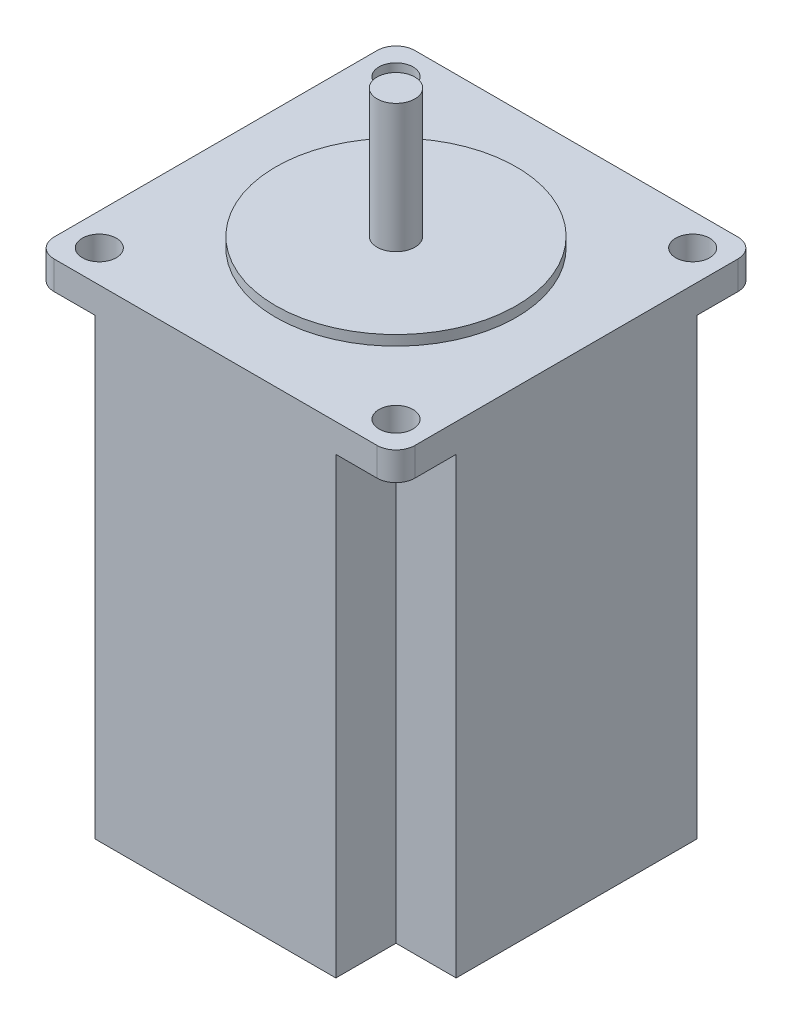
ISO-10303-21;
HEADER;
FILE_DESCRIPTION(('STEP AP214'),'2;1');
FILE_NAME('part.step','',(''),(''),'','','');
FILE_SCHEMA(('AUTOMOTIVE_DESIGN { 1 0 10303 214 1 1 1 1 }'));
ENDSEC;
DATA;
#1=APPLICATION_CONTEXT('core data for automotive mechanical design processes');
#2=APPLICATION_PROTOCOL_DEFINITION('international standard','automotive_design',2000,#1);
#3=PRODUCT_CONTEXT('',#1,'mechanical');
#4=PRODUCT('Part','Part','',(#3));
#5=PRODUCT_RELATED_PRODUCT_CATEGORY('part','',(#4));
#6=PRODUCT_DEFINITION_FORMATION('','',#4);
#7=PRODUCT_DEFINITION_CONTEXT('part definition',#1,'design');
#8=PRODUCT_DEFINITION('design','',#6,#7);
#9=PRODUCT_DEFINITION_SHAPE('','',#8);
#10=(LENGTH_UNIT() NAMED_UNIT(*) SI_UNIT(.MILLI.,.METRE.));
#11=(NAMED_UNIT(*) PLANE_ANGLE_UNIT() SI_UNIT($,.RADIAN.));
#12=(NAMED_UNIT(*) SI_UNIT($,.STERADIAN.) SOLID_ANGLE_UNIT());
#13=UNCERTAINTY_MEASURE_WITH_UNIT(LENGTH_MEASURE(1.E-05),#10,'distance_accuracy_value','');
#14=(GEOMETRIC_REPRESENTATION_CONTEXT(3) GLOBAL_UNCERTAINTY_ASSIGNED_CONTEXT((#13)) GLOBAL_UNIT_ASSIGNED_CONTEXT((#10,
#11,#12)) REPRESENTATION_CONTEXT('',''));
#15=CARTESIAN_POINT('',(0.,0.,0.));
#16=DIRECTION('',(0.,0.,1.));
#17=DIRECTION('',(1.,0.,0.));
#18=AXIS2_PLACEMENT_3D('',#15,#16,#17);
#19=CARTESIAN_POINT('',(-30.25,0.,0.));
#20=DIRECTION('',(1.,0.,0.));
#21=DIRECTION('',(0.,0.,-1.));
#22=AXIS2_PLACEMENT_3D('',#19,#20,#21);
#23=PLANE('',#22);
#24=DIRECTION('',(0.,1.,0.));
#25=VECTOR('',#24,1.);
#26=CARTESIAN_POINT('',(-30.25,0.,4.));
#27=LINE('',#26,#25);
#28=CARTESIAN_POINT('',(-30.25,0.,4.));
#29=VERTEX_POINT('',#28);
#30=CARTESIAN_POINT('',(-30.25,2.,4.));
#31=VERTEX_POINT('',#30);
#32=EDGE_CURVE('E59',#29,#31,#27,.T.);
#33=ORIENTED_EDGE('',*,*,#32,.F.);
#34=DIRECTION('',(0.,0.,1.));
#35=VECTOR('',#34,1.);
#36=CARTESIAN_POINT('',(-30.25,0.,0.));
#37=LINE('',#36,#35);
#38=CARTESIAN_POINT('',(-30.25,0.,5.45));
#39=VERTEX_POINT('',#38);
#40=EDGE_CURVE('E246',#29,#39,#37,.T.);
#41=ORIENTED_EDGE('',*,*,#40,.T.);
#42=DIRECTION('',(0.,1.,0.));
#43=VECTOR('',#42,1.);
#44=CARTESIAN_POINT('',(-30.25,9.6,5.45));
#45=LINE('',#44,#43);
#46=CARTESIAN_POINT('',(-30.25,9.6,5.45));
#47=VERTEX_POINT('',#46);
#48=EDGE_CURVE('E258',#39,#47,#45,.T.);
#49=ORIENTED_EDGE('',*,*,#48,.T.);
#50=DIRECTION('',(0.,0.,-1.));
#51=VECTOR('',#50,1.);
#52=CARTESIAN_POINT('',(-30.25,9.6,-5.45));
#53=LINE('',#52,#51);
#54=CARTESIAN_POINT('',(-30.25,9.6,-5.45));
#55=VERTEX_POINT('',#54);
#56=EDGE_CURVE('E260',#47,#55,#53,.T.);
#57=ORIENTED_EDGE('',*,*,#56,.T.);
#58=DIRECTION('',(0.,-1.,0.));
#59=VECTOR('',#58,1.);
#60=CARTESIAN_POINT('',(-30.25,0.,-5.45));
#61=LINE('',#60,#59);
#62=CARTESIAN_POINT('',(-30.25,0.,-5.45));
#63=VERTEX_POINT('',#62);
#64=EDGE_CURVE('E262',#55,#63,#61,.T.);
#65=ORIENTED_EDGE('',*,*,#64,.T.);
#66=CARTESIAN_POINT('',(-30.25,0.,-4.));
#67=VERTEX_POINT('',#66);
#68=EDGE_CURVE('E256',#63,#67,#37,.T.);
#69=ORIENTED_EDGE('',*,*,#68,.T.);
#70=DIRECTION('',(0.,-1.,0.));
#71=VECTOR('',#70,1.);
#72=CARTESIAN_POINT('',(-30.25,2.,-4.));
#73=LINE('',#72,#71);
#74=CARTESIAN_POINT('',(-30.25,2.,-4.));
#75=VERTEX_POINT('',#74);
#76=EDGE_CURVE('E241',#75,#67,#73,.T.);
#77=ORIENTED_EDGE('',*,*,#76,.F.);
#78=DIRECTION('',(0.,0.,-1.));
#79=VECTOR('',#78,1.);
#80=CARTESIAN_POINT('',(-30.25,2.,4.));
#81=LINE('',#80,#79);
#82=EDGE_CURVE('E55',#31,#75,#81,.T.);
#83=ORIENTED_EDGE('',*,*,#82,.F.);
#84=EDGE_LOOP('',(#33,#41,#49,#57,#65,#69,#77,#83));
#85=FACE_BOUND('',#84,.T.);
#86=ADVANCED_FACE('F40',(#85),#23,.F.);
#87=CARTESIAN_POINT('',(-28.65,76.5,-28.65));
#88=DIRECTION('',(1.,0.,0.));
#89=DIRECTION('',(0.,0.,-1.));
#90=AXIS2_PLACEMENT_3D('',#87,#88,#89);
#91=PLANE('',#90);
#92=DIRECTION('',(0.,1.,0.));
#93=VECTOR('',#92,1.);
#94=CARTESIAN_POINT('',(-28.65,9.6,5.45));
#95=LINE('',#94,#93);
#96=CARTESIAN_POINT('',(-28.65,0.,5.45000000000001));
#97=VERTEX_POINT('',#96);
#98=CARTESIAN_POINT('',(-28.65,9.6,5.45));
#99=VERTEX_POINT('',#98);
#100=EDGE_CURVE('E247',#97,#99,#95,.T.);
#101=ORIENTED_EDGE('',*,*,#100,.F.);
#102=DIRECTION('',(0.,0.,1.));
#103=VECTOR('',#102,1.);
#104=CARTESIAN_POINT('',(-28.65,0.,-28.65));
#105=LINE('',#104,#103);
#106=CARTESIAN_POINT('',(-28.65,0.,19.1));
#107=VERTEX_POINT('',#106);
#108=EDGE_CURVE('E405',#97,#107,#105,.T.);
#109=ORIENTED_EDGE('',*,*,#108,.T.);
#110=DIRECTION('',(0.,-1.,0.));
#111=VECTOR('',#110,1.);
#112=CARTESIAN_POINT('',(-28.65,72.,19.1));
#113=LINE('',#112,#111);
#114=CARTESIAN_POINT('',(-28.65,72.,19.1));
#115=VERTEX_POINT('',#114);
#116=EDGE_CURVE('E398',#115,#107,#113,.T.);
#117=ORIENTED_EDGE('',*,*,#116,.F.);
#118=DIRECTION('',(0.,0.,-1.));
#119=VECTOR('',#118,1.);
#120=CARTESIAN_POINT('',(-28.65,72.,19.1));
#121=LINE('',#120,#119);
#122=CARTESIAN_POINT('',(-28.65,72.,25.65));
#123=VERTEX_POINT('',#122);
#124=EDGE_CURVE('E386',#123,#115,#121,.T.);
#125=ORIENTED_EDGE('',*,*,#124,.F.);
#126=DIRECTION('',(0.,-1.,0.));
#127=VECTOR('',#126,1.);
#128=CARTESIAN_POINT('',(-28.65,76.5,25.65));
#129=LINE('',#128,#127);
#130=CARTESIAN_POINT('',(-28.65,76.5,25.65));
#131=VERTEX_POINT('',#130);
#132=EDGE_CURVE('E48',#123,#131,#129,.F.);
#133=ORIENTED_EDGE('',*,*,#132,.T.);
#134=DIRECTION('',(0.,0.,1.));
#135=VECTOR('',#134,1.);
#136=CARTESIAN_POINT('',(-28.65,76.5,-28.65));
#137=LINE('',#136,#135);
#138=CARTESIAN_POINT('',(-28.65,76.5,-25.65));
#139=VERTEX_POINT('',#138);
#140=EDGE_CURVE('E410',#139,#131,#137,.T.);
#141=ORIENTED_EDGE('',*,*,#140,.F.);
#142=DIRECTION('',(0.,-1.,0.));
#143=VECTOR('',#142,1.);
#144=CARTESIAN_POINT('',(-28.65,72.,-25.65));
#145=LINE('',#144,#143);
#146=CARTESIAN_POINT('',(-28.65,72.,-25.65));
#147=VERTEX_POINT('',#146);
#148=EDGE_CURVE('E458',#139,#147,#145,.T.);
#149=ORIENTED_EDGE('',*,*,#148,.T.);
#150=DIRECTION('',(0.,0.,1.));
#151=VECTOR('',#150,1.);
#152=CARTESIAN_POINT('',(-28.65,72.,-19.1));
#153=LINE('',#152,#151);
#154=CARTESIAN_POINT('',(-28.65,72.,-19.1));
#155=VERTEX_POINT('',#154);
#156=EDGE_CURVE('E320',#147,#155,#153,.T.);
#157=ORIENTED_EDGE('',*,*,#156,.T.);
#158=DIRECTION('',(0.,-1.,0.));
#159=VECTOR('',#158,1.);
#160=CARTESIAN_POINT('',(-28.65,72.,-19.1));
#161=LINE('',#160,#159);
#162=CARTESIAN_POINT('',(-28.65,0.,-19.1));
#163=VERTEX_POINT('',#162);
#164=EDGE_CURVE('E334',#155,#163,#161,.T.);
#165=ORIENTED_EDGE('',*,*,#164,.T.);
#166=CARTESIAN_POINT('',(-28.65,0.,-5.45));
#167=VERTEX_POINT('',#166);
#168=EDGE_CURVE('E422',#163,#167,#105,.T.);
#169=ORIENTED_EDGE('',*,*,#168,.T.);
#170=DIRECTION('',(0.,-1.,0.));
#171=VECTOR('',#170,1.);
#172=CARTESIAN_POINT('',(-28.65,0.,-5.45));
#173=LINE('',#172,#171);
#174=CARTESIAN_POINT('',(-28.65,9.6,-5.45));
#175=VERTEX_POINT('',#174);
#176=EDGE_CURVE('E267',#175,#167,#173,.T.);
#177=ORIENTED_EDGE('',*,*,#176,.F.);
#178=DIRECTION('',(0.,0.,-1.));
#179=VECTOR('',#178,1.);
#180=CARTESIAN_POINT('',(-28.65,9.6,-5.45));
#181=LINE('',#180,#179);
#182=EDGE_CURVE('E250',#99,#175,#181,.T.);
#183=ORIENTED_EDGE('',*,*,#182,.F.);
#184=EDGE_LOOP('',(#101,#109,#117,#125,#133,#141,#149,#157,#165,#169,#177,#183));
#185=FACE_BOUND('',#184,.T.);
#186=ADVANCED_FACE('F464',(#185),#91,.F.);
#187=CARTESIAN_POINT('',(0.,0.,0.));
#188=DIRECTION('',(0.,1.,0.));
#189=DIRECTION('',(0.,0.,1.));
#190=AXIS2_PLACEMENT_3D('',#187,#188,#189);
#191=PLANE('',#190);
#192=CARTESIAN_POINT('',(0.,0.,0.));
#193=DIRECTION('',(0.,-1.,0.));
#194=DIRECTION('',(0.,0.,-1.));
#195=AXIS2_PLACEMENT_3D('',#192,#193,#194);
#196=CIRCLE('',#195,3.);
#197=CARTESIAN_POINT('',(0.,0.,-3.));
#198=VERTEX_POINT('',#197);
#199=EDGE_CURVE('E962',#198,#198,#196,.T.);
#200=ORIENTED_EDGE('',*,*,#199,.F.);
#201=EDGE_LOOP('',(#200));
#202=FACE_BOUND('',#201,.T.);
#203=DIRECTION('',(1.,0.,0.));
#204=VECTOR('',#203,1.);
#205=CARTESIAN_POINT('',(-19.1,0.,-19.1));
#206=LINE('',#205,#204);
#207=CARTESIAN_POINT('',(-19.1,0.,-19.1));
#208=VERTEX_POINT('',#207);
#209=EDGE_CURVE('E323',#163,#208,#206,.T.);
#210=ORIENTED_EDGE('',*,*,#209,.T.);
#211=DIRECTION('',(0.,0.,-1.));
#212=VECTOR('',#211,1.);
#213=CARTESIAN_POINT('',(-19.1,0.,-28.65));
#214=LINE('',#213,#212);
#215=CARTESIAN_POINT('',(-19.1,0.,-28.65));
#216=VERTEX_POINT('',#215);
#217=EDGE_CURVE('E316',#208,#216,#214,.T.);
#218=ORIENTED_EDGE('',*,*,#217,.T.);
#219=DIRECTION('',(1.,0.,0.));
#220=VECTOR('',#219,1.);
#221=CARTESIAN_POINT('',(-28.65,0.,-28.65));
#222=LINE('',#221,#220);
#223=CARTESIAN_POINT('',(19.1,0.,-28.65));
#224=VERTEX_POINT('',#223);
#225=EDGE_CURVE('E414',#216,#224,#222,.T.);
#226=ORIENTED_EDGE('',*,*,#225,.T.);
#227=DIRECTION('',(0.,0.,-1.));
#228=VECTOR('',#227,1.);
#229=CARTESIAN_POINT('',(19.1,0.,-28.65));
#230=LINE('',#229,#228);
#231=CARTESIAN_POINT('',(19.1,0.,-19.1));
#232=VERTEX_POINT('',#231);
#233=EDGE_CURVE('E344',#232,#224,#230,.T.);
#234=ORIENTED_EDGE('',*,*,#233,.F.);
#235=DIRECTION('',(-1.,0.,0.));
#236=VECTOR('',#235,1.);
#237=CARTESIAN_POINT('',(19.1,0.,-19.1));
#238=LINE('',#237,#236);
#239=CARTESIAN_POINT('',(28.65,0.,-19.1));
#240=VERTEX_POINT('',#239);
#241=EDGE_CURVE('E337',#240,#232,#238,.T.);
#242=ORIENTED_EDGE('',*,*,#241,.F.);
#243=DIRECTION('',(0.,0.,1.));
#244=VECTOR('',#243,1.);
#245=CARTESIAN_POINT('',(28.65,0.,-28.65));
#246=LINE('',#245,#244);
#247=CARTESIAN_POINT('',(28.65,0.,19.1));
#248=VERTEX_POINT('',#247);
#249=EDGE_CURVE('E427',#240,#248,#246,.T.);
#250=ORIENTED_EDGE('',*,*,#249,.T.);
#251=DIRECTION('',(-1.,0.,0.));
#252=VECTOR('',#251,1.);
#253=CARTESIAN_POINT('',(19.1,0.,19.1));
#254=LINE('',#253,#252);
#255=CARTESIAN_POINT('',(19.1,0.,19.1));
#256=VERTEX_POINT('',#255);
#257=EDGE_CURVE('E367',#248,#256,#254,.T.);
#258=ORIENTED_EDGE('',*,*,#257,.T.);
#259=DIRECTION('',(0.,0.,1.));
#260=VECTOR('',#259,1.);
#261=CARTESIAN_POINT('',(19.1,0.,28.65));
#262=LINE('',#261,#260);
#263=CARTESIAN_POINT('',(19.1,0.,28.65));
#264=VERTEX_POINT('',#263);
#265=EDGE_CURVE('E360',#256,#264,#262,.T.);
#266=ORIENTED_EDGE('',*,*,#265,.T.);
#267=DIRECTION('',(1.,0.,0.));
#268=VECTOR('',#267,1.);
#269=CARTESIAN_POINT('',(-28.65,0.,28.65));
#270=LINE('',#269,#268);
#271=CARTESIAN_POINT('',(-19.1,0.,28.65));
#272=VERTEX_POINT('',#271);
#273=EDGE_CURVE('E424',#272,#264,#270,.T.);
#274=ORIENTED_EDGE('',*,*,#273,.F.);
#275=DIRECTION('',(0.,0.,1.));
#276=VECTOR('',#275,1.);
#277=CARTESIAN_POINT('',(-19.1,0.,28.65));
#278=LINE('',#277,#276);
#279=CARTESIAN_POINT('',(-19.1,0.,19.1));
#280=VERTEX_POINT('',#279);
#281=EDGE_CURVE('E389',#280,#272,#278,.T.);
#282=ORIENTED_EDGE('',*,*,#281,.F.);
#283=DIRECTION('',(1.,0.,0.));
#284=VECTOR('',#283,1.);
#285=CARTESIAN_POINT('',(-19.1,0.,19.1));
#286=LINE('',#285,#284);
#287=EDGE_CURVE('E382',#107,#280,#286,.T.);
#288=ORIENTED_EDGE('',*,*,#287,.F.);
#289=ORIENTED_EDGE('',*,*,#108,.F.);
#290=DIRECTION('',(1.,0.,0.));
#291=VECTOR('',#290,1.);
#292=CARTESIAN_POINT('',(-30.25,0.,5.45));
#293=LINE('',#292,#291);
#294=EDGE_CURVE('E278',#39,#97,#293,.T.);
#295=ORIENTED_EDGE('',*,*,#294,.F.);
#296=ORIENTED_EDGE('',*,*,#40,.F.);
#297=DIRECTION('',(1.,0.,0.));
#298=VECTOR('',#297,1.);
#299=CARTESIAN_POINT('',(-35.35,0.,4.));
#300=LINE('',#299,#298);
#301=CARTESIAN_POINT('',(-35.35,0.,4.));
#302=VERTEX_POINT('',#301);
#303=EDGE_CURVE('E226',#302,#29,#300,.T.);
#304=ORIENTED_EDGE('',*,*,#303,.F.);
#305=DIRECTION('',(0.,0.,1.));
#306=VECTOR('',#305,1.);
#307=CARTESIAN_POINT('',(-35.35,0.,0.));
#308=LINE('',#307,#306);
#309=CARTESIAN_POINT('',(-35.35,0.,-4.));
#310=VERTEX_POINT('',#309);
#311=EDGE_CURVE('E232',#310,#302,#308,.T.);
#312=ORIENTED_EDGE('',*,*,#311,.F.);
#313=DIRECTION('',(1.,0.,0.));
#314=VECTOR('',#313,1.);
#315=CARTESIAN_POINT('',(-35.35,0.,-4.));
#316=LINE('',#315,#314);
#317=EDGE_CURVE('E971',#310,#67,#316,.T.);
#318=ORIENTED_EDGE('',*,*,#317,.T.);
#319=ORIENTED_EDGE('',*,*,#68,.F.);
#320=DIRECTION('',(1.,0.,0.));
#321=VECTOR('',#320,1.);
#322=CARTESIAN_POINT('',(-30.25,0.,-5.45));
#323=LINE('',#322,#321);
#324=EDGE_CURVE('E263',#63,#167,#323,.T.);
#325=ORIENTED_EDGE('',*,*,#324,.T.);
#326=ORIENTED_EDGE('',*,*,#168,.F.);
#327=EDGE_LOOP('',(#210,#218,#226,#234,#242,#250,#258,#266,#274,#282,#288,#289,#295,#296,#304,
#312,#318,#319,#325,#326));
#328=FACE_BOUND('',#327,.T.);
#329=ADVANCED_FACE('F244',(#202,#328),#191,.F.);
#330=CARTESIAN_POINT('',(-28.65,76.5,-28.65));
#331=DIRECTION('',(0.,0.,-1.));
#332=DIRECTION('',(-1.,0.,0.));
#333=AXIS2_PLACEMENT_3D('',#330,#331,#332);
#334=PLANE('',#333);
#335=DIRECTION('',(1.,0.,0.));
#336=VECTOR('',#335,1.);
#337=CARTESIAN_POINT('',(-28.65,76.5,-28.65));
#338=LINE('',#337,#336);
#339=CARTESIAN_POINT('',(-25.65,76.5,-28.65));
#340=VERTEX_POINT('',#339);
#341=CARTESIAN_POINT('',(25.65,76.5,-28.65));
#342=VERTEX_POINT('',#341);
#343=EDGE_CURVE('E319',#340,#342,#338,.T.);
#344=ORIENTED_EDGE('',*,*,#343,.T.);
#345=DIRECTION('',(0.,-1.,0.));
#346=VECTOR('',#345,1.);
#347=CARTESIAN_POINT('',(25.65,76.5,-28.65));
#348=LINE('',#347,#346);
#349=CARTESIAN_POINT('',(25.65,72.,-28.65));
#350=VERTEX_POINT('',#349);
#351=EDGE_CURVE('E451',#342,#350,#348,.T.);
#352=ORIENTED_EDGE('',*,*,#351,.T.);
#353=DIRECTION('',(1.,0.,0.));
#354=VECTOR('',#353,1.);
#355=CARTESIAN_POINT('',(28.65,72.,-28.65));
#356=LINE('',#355,#354);
#357=CARTESIAN_POINT('',(19.1,72.,-28.65));
#358=VERTEX_POINT('',#357);
#359=EDGE_CURVE('E349',#358,#350,#356,.T.);
#360=ORIENTED_EDGE('',*,*,#359,.F.);
#361=DIRECTION('',(0.,-1.,0.));
#362=VECTOR('',#361,1.);
#363=CARTESIAN_POINT('',(19.1,72.,-28.65));
#364=LINE('',#363,#362);
#365=EDGE_CURVE('E357',#358,#224,#364,.T.);
#366=ORIENTED_EDGE('',*,*,#365,.T.);
#367=ORIENTED_EDGE('',*,*,#225,.F.);
#368=DIRECTION('',(0.,-1.,0.));
#369=VECTOR('',#368,1.);
#370=CARTESIAN_POINT('',(-19.1,72.,-28.65));
#371=LINE('',#370,#369);
#372=CARTESIAN_POINT('',(-19.1,72.,-28.65));
#373=VERTEX_POINT('',#372);
#374=EDGE_CURVE('E330',#373,#216,#371,.T.);
#375=ORIENTED_EDGE('',*,*,#374,.F.);
#376=DIRECTION('',(-1.,0.,0.));
#377=VECTOR('',#376,1.);
#378=CARTESIAN_POINT('',(-28.65,72.,-28.65));
#379=LINE('',#378,#377);
#380=CARTESIAN_POINT('',(-25.65,72.,-28.65));
#381=VERTEX_POINT('',#380);
#382=EDGE_CURVE('E322',#373,#381,#379,.T.);
#383=ORIENTED_EDGE('',*,*,#382,.T.);
#384=DIRECTION('',(0.,-1.,0.));
#385=VECTOR('',#384,1.);
#386=CARTESIAN_POINT('',(-25.65,76.5,-28.65));
#387=LINE('',#386,#385);
#388=EDGE_CURVE('E449',#381,#340,#387,.F.);
#389=ORIENTED_EDGE('',*,*,#388,.T.);
#390=EDGE_LOOP('',(#344,#352,#360,#366,#367,#375,#383,#389));
#391=FACE_BOUND('',#390,.T.);
#392=ADVANCED_FACE('F514',(#391),#334,.T.);
#393=CARTESIAN_POINT('',(-28.65,76.5,28.65));
#394=DIRECTION('',(0.,0.,-1.));
#395=DIRECTION('',(-1.,0.,0.));
#396=AXIS2_PLACEMENT_3D('',#393,#394,#395);
#397=PLANE('',#396);
#398=DIRECTION('',(1.,0.,0.));
#399=VECTOR('',#398,1.);
#400=CARTESIAN_POINT('',(28.65,72.,28.65));
#401=LINE('',#400,#399);
#402=CARTESIAN_POINT('',(19.1,72.,28.65));
#403=VERTEX_POINT('',#402);
#404=CARTESIAN_POINT('',(25.65,72.,28.65));
#405=VERTEX_POINT('',#404);
#406=EDGE_CURVE('E366',#403,#405,#401,.T.);
#407=ORIENTED_EDGE('',*,*,#406,.T.);
#408=DIRECTION('',(0.,-1.,0.));
#409=VECTOR('',#408,1.);
#410=CARTESIAN_POINT('',(25.65,76.5,28.65));
#411=LINE('',#410,#409);
#412=CARTESIAN_POINT('',(25.65,76.5,28.65));
#413=VERTEX_POINT('',#412);
#414=EDGE_CURVE('E439',#405,#413,#411,.F.);
#415=ORIENTED_EDGE('',*,*,#414,.T.);
#416=DIRECTION('',(1.,0.,0.));
#417=VECTOR('',#416,1.);
#418=CARTESIAN_POINT('',(-28.65,76.5,28.65));
#419=LINE('',#418,#417);
#420=CARTESIAN_POINT('',(-25.65,76.5,28.65));
#421=VERTEX_POINT('',#420);
#422=EDGE_CURVE('E413',#421,#413,#419,.T.);
#423=ORIENTED_EDGE('',*,*,#422,.F.);
#424=DIRECTION('',(0.,-1.,0.));
#425=VECTOR('',#424,1.);
#426=CARTESIAN_POINT('',(-25.65,76.5,28.65));
#427=LINE('',#426,#425);
#428=CARTESIAN_POINT('',(-25.65,72.,28.65));
#429=VERTEX_POINT('',#428);
#430=EDGE_CURVE('E436',#421,#429,#427,.T.);
#431=ORIENTED_EDGE('',*,*,#430,.T.);
#432=DIRECTION('',(-1.,0.,0.));
#433=VECTOR('',#432,1.);
#434=CARTESIAN_POINT('',(-28.65,72.,28.65));
#435=LINE('',#434,#433);
#436=CARTESIAN_POINT('',(-19.1,72.,28.65));
#437=VERTEX_POINT('',#436);
#438=EDGE_CURVE('E395',#437,#429,#435,.T.);
#439=ORIENTED_EDGE('',*,*,#438,.F.);
#440=DIRECTION('',(0.,-1.,0.));
#441=VECTOR('',#440,1.);
#442=CARTESIAN_POINT('',(-19.1,72.,28.65));
#443=LINE('',#442,#441);
#444=EDGE_CURVE('E402',#437,#272,#443,.T.);
#445=ORIENTED_EDGE('',*,*,#444,.T.);
#446=ORIENTED_EDGE('',*,*,#273,.T.);
#447=DIRECTION('',(0.,-1.,0.));
#448=VECTOR('',#447,1.);
#449=CARTESIAN_POINT('',(19.1,72.,28.65));
#450=LINE('',#449,#448);
#451=EDGE_CURVE('E374',#403,#264,#450,.T.);
#452=ORIENTED_EDGE('',*,*,#451,.F.);
#453=EDGE_LOOP('',(#407,#415,#423,#431,#439,#445,#446,#452));
#454=FACE_BOUND('',#453,.T.);
#455=ADVANCED_FACE('F478',(#454),#397,.F.);
#456=CARTESIAN_POINT('',(28.65,76.5,-28.65));
#457=DIRECTION('',(1.,0.,0.));
#458=DIRECTION('',(0.,0.,-1.));
#459=AXIS2_PLACEMENT_3D('',#456,#457,#458);
#460=PLANE('',#459);
#461=DIRECTION('',(0.,0.,1.));
#462=VECTOR('',#461,1.);
#463=CARTESIAN_POINT('',(28.65,76.5,-28.65));
#464=LINE('',#463,#462);
#465=CARTESIAN_POINT('',(28.65,76.5,-25.65));
#466=VERTEX_POINT('',#465);
#467=CARTESIAN_POINT('',(28.65,76.5,25.65));
#468=VERTEX_POINT('',#467);
#469=EDGE_CURVE('E417',#466,#468,#464,.T.);
#470=ORIENTED_EDGE('',*,*,#469,.T.);
#471=DIRECTION('',(0.,-1.,0.));
#472=VECTOR('',#471,1.);
#473=CARTESIAN_POINT('',(28.65,72.,25.65));
#474=LINE('',#473,#472);
#475=CARTESIAN_POINT('',(28.65,72.,25.65));
#476=VERTEX_POINT('',#475);
#477=EDGE_CURVE('E431',#468,#476,#474,.T.);
#478=ORIENTED_EDGE('',*,*,#477,.T.);
#479=DIRECTION('',(0.,0.,-1.));
#480=VECTOR('',#479,1.);
#481=CARTESIAN_POINT('',(28.65,72.,19.1));
#482=LINE('',#481,#480);
#483=CARTESIAN_POINT('',(28.65,72.,19.1));
#484=VERTEX_POINT('',#483);
#485=EDGE_CURVE('E364',#476,#484,#482,.T.);
#486=ORIENTED_EDGE('',*,*,#485,.T.);
#487=DIRECTION('',(0.,-1.,0.));
#488=VECTOR('',#487,1.);
#489=CARTESIAN_POINT('',(28.65,72.,19.1));
#490=LINE('',#489,#488);
#491=EDGE_CURVE('E379',#484,#248,#490,.T.);
#492=ORIENTED_EDGE('',*,*,#491,.T.);
#493=ORIENTED_EDGE('',*,*,#249,.F.);
#494=DIRECTION('',(0.,-1.,0.));
#495=VECTOR('',#494,1.);
#496=CARTESIAN_POINT('',(28.65,72.,-19.1));
#497=LINE('',#496,#495);
#498=CARTESIAN_POINT('',(28.65,72.,-19.1));
#499=VERTEX_POINT('',#498);
#500=EDGE_CURVE('E352',#499,#240,#497,.T.);
#501=ORIENTED_EDGE('',*,*,#500,.F.);
#502=DIRECTION('',(0.,0.,1.));
#503=VECTOR('',#502,1.);
#504=CARTESIAN_POINT('',(28.65,72.,-19.1));
#505=LINE('',#504,#503);
#506=CARTESIAN_POINT('',(28.65,72.,-25.65));
#507=VERTEX_POINT('',#506);
#508=EDGE_CURVE('E341',#507,#499,#505,.T.);
#509=ORIENTED_EDGE('',*,*,#508,.F.);
#510=DIRECTION('',(0.,-1.,0.));
#511=VECTOR('',#510,1.);
#512=CARTESIAN_POINT('',(28.65,76.5,-25.65));
#513=LINE('',#512,#511);
#514=EDGE_CURVE('E312',#507,#466,#513,.F.);
#515=ORIENTED_EDGE('',*,*,#514,.T.);
#516=EDGE_LOOP('',(#470,#478,#486,#492,#493,#501,#509,#515));
#517=FACE_BOUND('',#516,.T.);
#518=ADVANCED_FACE('F505',(#517),#460,.T.);
#519=CARTESIAN_POINT('',(0.,76.5,0.));
#520=DIRECTION('',(0.,1.,0.));
#521=DIRECTION('',(0.,0.,1.));
#522=AXIS2_PLACEMENT_3D('',#519,#520,#521);
#523=PLANE('',#522);
#524=CARTESIAN_POINT('',(-23.55,76.5,23.55));
#525=DIRECTION('',(0.,1.,0.));
#526=DIRECTION('',(0.,0.,1.));
#527=AXIS2_PLACEMENT_3D('',#524,#525,#526);
#528=CIRCLE('',#527,2.7);
#529=CARTESIAN_POINT('',(-23.55,76.5,26.25));
#530=VERTEX_POINT('',#529);
#531=EDGE_CURVE('E281',#530,#530,#528,.T.);
#532=ORIENTED_EDGE('',*,*,#531,.F.);
#533=EDGE_LOOP('',(#532));
#534=FACE_BOUND('',#533,.T.);
#535=CARTESIAN_POINT('',(23.55,76.5,23.55));
#536=DIRECTION('',(0.,1.,0.));
#537=DIRECTION('',(0.,0.,1.));
#538=AXIS2_PLACEMENT_3D('',#535,#536,#537);
#539=CIRCLE('',#538,2.7);
#540=CARTESIAN_POINT('',(23.55,76.5,26.25));
#541=VERTEX_POINT('',#540);
#542=EDGE_CURVE('E290',#541,#541,#539,.T.);
#543=ORIENTED_EDGE('',*,*,#542,.F.);
#544=EDGE_LOOP('',(#543));
#545=FACE_BOUND('',#544,.T.);
#546=CARTESIAN_POINT('',(23.55,76.5,-23.55));
#547=DIRECTION('',(0.,1.,0.));
#548=DIRECTION('',(0.,0.,1.));
#549=AXIS2_PLACEMENT_3D('',#546,#547,#548);
#550=CIRCLE('',#549,2.7);
#551=CARTESIAN_POINT('',(23.55,76.5,-20.85));
#552=VERTEX_POINT('',#551);
#553=EDGE_CURVE('E282',#552,#552,#550,.T.);
#554=ORIENTED_EDGE('',*,*,#553,.F.);
#555=EDGE_LOOP('',(#554));
#556=FACE_BOUND('',#555,.T.);
#557=CARTESIAN_POINT('',(-23.55,76.5,-23.55));
#558=DIRECTION('',(0.,1.,0.));
#559=DIRECTION('',(0.,0.,1.));
#560=AXIS2_PLACEMENT_3D('',#557,#558,#559);
#561=CIRCLE('',#560,2.7);
#562=CARTESIAN_POINT('',(-23.55,76.5,-20.85));
#563=VERTEX_POINT('',#562);
#564=EDGE_CURVE('E289',#563,#563,#561,.T.);
#565=ORIENTED_EDGE('',*,*,#564,.F.);
#566=EDGE_LOOP('',(#565));
#567=FACE_BOUND('',#566,.T.);
#568=CARTESIAN_POINT('',(0.,76.5,0.));
#569=DIRECTION('',(0.,1.,0.));
#570=DIRECTION('',(0.,0.,1.));
#571=AXIS2_PLACEMENT_3D('',#568,#569,#570);
#572=CIRCLE('',#571,19.1);
#573=CARTESIAN_POINT('',(0.,76.5,19.1));
#574=VERTEX_POINT('',#573);
#575=EDGE_CURVE('E313',#574,#574,#572,.T.);
#576=ORIENTED_EDGE('',*,*,#575,.F.);
#577=EDGE_LOOP('',(#576));
#578=FACE_BOUND('',#577,.T.);
#579=ORIENTED_EDGE('',*,*,#422,.T.);
#580=CARTESIAN_POINT('',(25.65,76.5,25.65));
#581=DIRECTION('',(0.,1.,0.));
#582=DIRECTION('',(0.,0.,1.));
#583=AXIS2_PLACEMENT_3D('',#580,#581,#582);
#584=CIRCLE('',#583,3.);
#585=EDGE_CURVE('E447',#413,#468,#584,.T.);
#586=ORIENTED_EDGE('',*,*,#585,.T.);
#587=ORIENTED_EDGE('',*,*,#469,.F.);
#588=CARTESIAN_POINT('',(25.65,76.5,-25.65));
#589=DIRECTION('',(0.,1.,0.));
#590=DIRECTION('',(0.,0.,1.));
#591=AXIS2_PLACEMENT_3D('',#588,#589,#590);
#592=CIRCLE('',#591,3.);
#593=EDGE_CURVE('E445',#466,#342,#592,.T.);
#594=ORIENTED_EDGE('',*,*,#593,.T.);
#595=ORIENTED_EDGE('',*,*,#343,.F.);
#596=CARTESIAN_POINT('',(-25.65,76.5,-25.65));
#597=DIRECTION('',(0.,1.,0.));
#598=DIRECTION('',(0.,0.,1.));
#599=AXIS2_PLACEMENT_3D('',#596,#597,#598);
#600=CIRCLE('',#599,3.);
#601=EDGE_CURVE('E441',#340,#139,#600,.T.);
#602=ORIENTED_EDGE('',*,*,#601,.T.);
#603=ORIENTED_EDGE('',*,*,#140,.T.);
#604=CARTESIAN_POINT('',(-25.65,76.5,25.65));
#605=DIRECTION('',(0.,1.,0.));
#606=DIRECTION('',(0.,0.,1.));
#607=AXIS2_PLACEMENT_3D('',#604,#605,#606);
#608=CIRCLE('',#607,3.);
#609=EDGE_CURVE('E443',#131,#421,#608,.T.);
#610=ORIENTED_EDGE('',*,*,#609,.T.);
#611=EDGE_LOOP('',(#579,#586,#587,#594,#595,#602,#603,#610));
#612=FACE_BOUND('',#611,.T.);
#613=ADVANCED_FACE('F470',(#534,#545,#556,#567,#578,#612),#523,.T.);
#614=CARTESIAN_POINT('',(-19.1,72.,28.65));
#615=DIRECTION('',(1.,0.,0.));
#616=DIRECTION('',(0.,0.,-1.));
#617=AXIS2_PLACEMENT_3D('',#614,#615,#616);
#618=PLANE('',#617);
#619=ORIENTED_EDGE('',*,*,#281,.T.);
#620=ORIENTED_EDGE('',*,*,#444,.F.);
#621=DIRECTION('',(0.,0.,1.));
#622=VECTOR('',#621,1.);
#623=CARTESIAN_POINT('',(-19.1,72.,28.65));
#624=LINE('',#623,#622);
#625=CARTESIAN_POINT('',(-19.1,72.,19.1));
#626=VERTEX_POINT('',#625);
#627=EDGE_CURVE('E392',#626,#437,#624,.T.);
#628=ORIENTED_EDGE('',*,*,#627,.F.);
#629=DIRECTION('',(0.,-1.,0.));
#630=VECTOR('',#629,1.);
#631=CARTESIAN_POINT('',(-19.1,72.,19.1));
#632=LINE('',#631,#630);
#633=EDGE_CURVE('E406',#626,#280,#632,.T.);
#634=ORIENTED_EDGE('',*,*,#633,.T.);
#635=EDGE_LOOP('',(#619,#620,#628,#634));
#636=FACE_BOUND('',#635,.T.);
#637=ADVANCED_FACE('F484',(#636),#618,.F.);
#638=CARTESIAN_POINT('',(-19.1,72.,19.1));
#639=DIRECTION('',(0.,0.,-1.));
#640=DIRECTION('',(-1.,0.,0.));
#641=AXIS2_PLACEMENT_3D('',#638,#639,#640);
#642=PLANE('',#641);
#643=ORIENTED_EDGE('',*,*,#287,.T.);
#644=ORIENTED_EDGE('',*,*,#633,.F.);
#645=DIRECTION('',(1.,0.,0.));
#646=VECTOR('',#645,1.);
#647=CARTESIAN_POINT('',(-19.1,72.,19.1));
#648=LINE('',#647,#646);
#649=EDGE_CURVE('E388',#115,#626,#648,.T.);
#650=ORIENTED_EDGE('',*,*,#649,.F.);
#651=ORIENTED_EDGE('',*,*,#116,.T.);
#652=EDGE_LOOP('',(#643,#644,#650,#651));
#653=FACE_BOUND('',#652,.T.);
#654=ADVANCED_FACE('F545',(#653),#642,.F.);
#655=CARTESIAN_POINT('',(0.,72.,0.));
#656=DIRECTION('',(0.,1.,0.));
#657=DIRECTION('',(0.,0.,1.));
#658=AXIS2_PLACEMENT_3D('',#655,#656,#657);
#659=PLANE('',#658);
#660=CARTESIAN_POINT('',(-23.55,72.,23.55));
#661=DIRECTION('',(0.,1.,0.));
#662=DIRECTION('',(0.,0.,1.));
#663=AXIS2_PLACEMENT_3D('',#660,#661,#662);
#664=CIRCLE('',#663,2.7);
#665=CARTESIAN_POINT('',(-23.55,72.,26.25));
#666=VERTEX_POINT('',#665);
#667=EDGE_CURVE('E293',#666,#666,#664,.F.);
#668=ORIENTED_EDGE('',*,*,#667,.F.);
#669=EDGE_LOOP('',(#668));
#670=FACE_BOUND('',#669,.T.);
#671=ORIENTED_EDGE('',*,*,#438,.T.);
#672=CARTESIAN_POINT('',(-25.65,72.,25.65));
#673=DIRECTION('',(0.,1.,0.));
#674=DIRECTION('',(0.,0.,1.));
#675=AXIS2_PLACEMENT_3D('',#672,#673,#674);
#676=CIRCLE('',#675,3.);
#677=EDGE_CURVE('E456',#429,#123,#676,.F.);
#678=ORIENTED_EDGE('',*,*,#677,.T.);
#679=ORIENTED_EDGE('',*,*,#124,.T.);
#680=ORIENTED_EDGE('',*,*,#649,.T.);
#681=ORIENTED_EDGE('',*,*,#627,.T.);
#682=EDGE_LOOP('',(#671,#678,#679,#680,#681));
#683=FACE_BOUND('',#682,.T.);
#684=ADVANCED_FACE('F480',(#670,#683),#659,.F.);
#685=CARTESIAN_POINT('',(19.1,72.,19.1));
#686=DIRECTION('',(0.,0.,1.));
#687=DIRECTION('',(1.,0.,0.));
#688=AXIS2_PLACEMENT_3D('',#685,#686,#687);
#689=PLANE('',#688);
#690=ORIENTED_EDGE('',*,*,#257,.F.);
#691=ORIENTED_EDGE('',*,*,#491,.F.);
#692=DIRECTION('',(-1.,0.,0.));
#693=VECTOR('',#692,1.);
#694=CARTESIAN_POINT('',(19.1,72.,19.1));
#695=LINE('',#694,#693);
#696=CARTESIAN_POINT('',(19.1,72.,19.1));
#697=VERTEX_POINT('',#696);
#698=EDGE_CURVE('E372',#484,#697,#695,.T.);
#699=ORIENTED_EDGE('',*,*,#698,.T.);
#700=DIRECTION('',(0.,-1.,0.));
#701=VECTOR('',#700,1.);
#702=CARTESIAN_POINT('',(19.1,72.,19.1));
#703=LINE('',#702,#701);
#704=EDGE_CURVE('E383',#697,#256,#703,.T.);
#705=ORIENTED_EDGE('',*,*,#704,.T.);
#706=EDGE_LOOP('',(#690,#691,#699,#705));
#707=FACE_BOUND('',#706,.T.);
#708=ADVANCED_FACE('F552',(#707),#689,.T.);
#709=CARTESIAN_POINT('',(19.1,72.,28.65));
#710=DIRECTION('',(1.,0.,0.));
#711=DIRECTION('',(0.,0.,-1.));
#712=AXIS2_PLACEMENT_3D('',#709,#710,#711);
#713=PLANE('',#712);
#714=ORIENTED_EDGE('',*,*,#265,.F.);
#715=ORIENTED_EDGE('',*,*,#704,.F.);
#716=DIRECTION('',(0.,0.,1.));
#717=VECTOR('',#716,1.);
#718=CARTESIAN_POINT('',(19.1,72.,28.65));
#719=LINE('',#718,#717);
#720=EDGE_CURVE('E370',#697,#403,#719,.T.);
#721=ORIENTED_EDGE('',*,*,#720,.T.);
#722=ORIENTED_EDGE('',*,*,#451,.T.);
#723=EDGE_LOOP('',(#714,#715,#721,#722));
#724=FACE_BOUND('',#723,.T.);
#725=ADVANCED_FACE('F493',(#724),#713,.T.);
#726=CARTESIAN_POINT('',(0.,72.,0.));
#727=DIRECTION('',(0.,1.,0.));
#728=DIRECTION('',(0.,0.,1.));
#729=AXIS2_PLACEMENT_3D('',#726,#727,#728);
#730=PLANE('',#729);
#731=CARTESIAN_POINT('',(23.55,72.,23.55));
#732=DIRECTION('',(0.,1.,0.));
#733=DIRECTION('',(0.,0.,1.));
#734=AXIS2_PLACEMENT_3D('',#731,#732,#733);
#735=CIRCLE('',#734,2.7);
#736=CARTESIAN_POINT('',(23.55,72.,26.25));
#737=VERTEX_POINT('',#736);
#738=EDGE_CURVE('E286',#737,#737,#735,.F.);
#739=ORIENTED_EDGE('',*,*,#738,.F.);
#740=EDGE_LOOP('',(#739));
#741=FACE_BOUND('',#740,.T.);
#742=ORIENTED_EDGE('',*,*,#485,.F.);
#743=CARTESIAN_POINT('',(25.65,72.,25.65));
#744=DIRECTION('',(0.,1.,0.));
#745=DIRECTION('',(0.,0.,1.));
#746=AXIS2_PLACEMENT_3D('',#743,#744,#745);
#747=CIRCLE('',#746,3.);
#748=EDGE_CURVE('E434',#476,#405,#747,.F.);
#749=ORIENTED_EDGE('',*,*,#748,.T.);
#750=ORIENTED_EDGE('',*,*,#406,.F.);
#751=ORIENTED_EDGE('',*,*,#720,.F.);
#752=ORIENTED_EDGE('',*,*,#698,.F.);
#753=EDGE_LOOP('',(#742,#749,#750,#751,#752));
#754=FACE_BOUND('',#753,.T.);
#755=ADVANCED_FACE('F621',(#741,#754),#730,.F.);
#756=CARTESIAN_POINT('',(19.1,72.,-28.65));
#757=DIRECTION('',(-1.,0.,0.));
#758=DIRECTION('',(0.,0.,1.));
#759=AXIS2_PLACEMENT_3D('',#756,#757,#758);
#760=PLANE('',#759);
#761=ORIENTED_EDGE('',*,*,#233,.T.);
#762=ORIENTED_EDGE('',*,*,#365,.F.);
#763=DIRECTION('',(0.,0.,-1.));
#764=VECTOR('',#763,1.);
#765=CARTESIAN_POINT('',(19.1,72.,-28.65));
#766=LINE('',#765,#764);
#767=CARTESIAN_POINT('',(19.1,72.,-19.1));
#768=VERTEX_POINT('',#767);
#769=EDGE_CURVE('E347',#768,#358,#766,.T.);
#770=ORIENTED_EDGE('',*,*,#769,.F.);
#771=DIRECTION('',(0.,-1.,0.));
#772=VECTOR('',#771,1.);
#773=CARTESIAN_POINT('',(19.1,72.,-19.1));
#774=LINE('',#773,#772);
#775=EDGE_CURVE('E361',#768,#232,#774,.T.);
#776=ORIENTED_EDGE('',*,*,#775,.T.);
#777=EDGE_LOOP('',(#761,#762,#770,#776));
#778=FACE_BOUND('',#777,.T.);
#779=ADVANCED_FACE('F618',(#778),#760,.F.);
#780=CARTESIAN_POINT('',(19.1,72.,-19.1));
#781=DIRECTION('',(0.,0.,1.));
#782=DIRECTION('',(1.,0.,0.));
#783=AXIS2_PLACEMENT_3D('',#780,#781,#782);
#784=PLANE('',#783);
#785=ORIENTED_EDGE('',*,*,#241,.T.);
#786=ORIENTED_EDGE('',*,*,#775,.F.);
#787=DIRECTION('',(-1.,0.,0.));
#788=VECTOR('',#787,1.);
#789=CARTESIAN_POINT('',(19.1,72.,-19.1));
#790=LINE('',#789,#788);
#791=EDGE_CURVE('E343',#499,#768,#790,.T.);
#792=ORIENTED_EDGE('',*,*,#791,.F.);
#793=ORIENTED_EDGE('',*,*,#500,.T.);
#794=EDGE_LOOP('',(#785,#786,#792,#793));
#795=FACE_BOUND('',#794,.T.);
#796=ADVANCED_FACE('F616',(#795),#784,.F.);
#797=CARTESIAN_POINT('',(0.,72.,0.));
#798=DIRECTION('',(0.,1.,0.));
#799=DIRECTION('',(0.,0.,-1.));
#800=AXIS2_PLACEMENT_3D('',#797,#798,#799);
#801=PLANE('',#800);
#802=CARTESIAN_POINT('',(23.55,72.,-23.55));
#803=DIRECTION('',(0.,1.,0.));
#804=DIRECTION('',(0.,0.,1.));
#805=AXIS2_PLACEMENT_3D('',#802,#803,#804);
#806=CIRCLE('',#805,2.7);
#807=CARTESIAN_POINT('',(23.55,72.,-20.85));
#808=VERTEX_POINT('',#807);
#809=EDGE_CURVE('E285',#808,#808,#806,.F.);
#810=ORIENTED_EDGE('',*,*,#809,.F.);
#811=EDGE_LOOP('',(#810));
#812=FACE_BOUND('',#811,.T.);
#813=ORIENTED_EDGE('',*,*,#359,.T.);
#814=CARTESIAN_POINT('',(25.65,72.,-25.65));
#815=DIRECTION('',(0.,1.,0.));
#816=DIRECTION('',(0.,0.,1.));
#817=AXIS2_PLACEMENT_3D('',#814,#815,#816);
#818=CIRCLE('',#817,3.);
#819=EDGE_CURVE('E454',#350,#507,#818,.F.);
#820=ORIENTED_EDGE('',*,*,#819,.T.);
#821=ORIENTED_EDGE('',*,*,#508,.T.);
#822=ORIENTED_EDGE('',*,*,#791,.T.);
#823=ORIENTED_EDGE('',*,*,#769,.T.);
#824=EDGE_LOOP('',(#813,#820,#821,#822,#823));
#825=FACE_BOUND('',#824,.T.);
#826=ADVANCED_FACE('F610',(#812,#825),#801,.F.);
#827=CARTESIAN_POINT('',(-19.1,72.,-19.1));
#828=DIRECTION('',(0.,0.,-1.));
#829=DIRECTION('',(-1.,0.,0.));
#830=AXIS2_PLACEMENT_3D('',#827,#828,#829);
#831=PLANE('',#830);
#832=ORIENTED_EDGE('',*,*,#209,.F.);
#833=ORIENTED_EDGE('',*,*,#164,.F.);
#834=DIRECTION('',(1.,0.,0.));
#835=VECTOR('',#834,1.);
#836=CARTESIAN_POINT('',(-19.1,72.,-19.1));
#837=LINE('',#836,#835);
#838=CARTESIAN_POINT('',(-19.1,72.,-19.1));
#839=VERTEX_POINT('',#838);
#840=EDGE_CURVE('E328',#155,#839,#837,.T.);
#841=ORIENTED_EDGE('',*,*,#840,.T.);
#842=DIRECTION('',(0.,-1.,0.));
#843=VECTOR('',#842,1.);
#844=CARTESIAN_POINT('',(-19.1,72.,-19.1));
#845=LINE('',#844,#843);
#846=EDGE_CURVE('E338',#839,#208,#845,.T.);
#847=ORIENTED_EDGE('',*,*,#846,.T.);
#848=EDGE_LOOP('',(#832,#833,#841,#847));
#849=FACE_BOUND('',#848,.T.);
#850=ADVANCED_FACE('F528',(#849),#831,.T.);
#851=CARTESIAN_POINT('',(-19.1,72.,-28.65));
#852=DIRECTION('',(-1.,0.,0.));
#853=DIRECTION('',(0.,0.,1.));
#854=AXIS2_PLACEMENT_3D('',#851,#852,#853);
#855=PLANE('',#854);
#856=ORIENTED_EDGE('',*,*,#217,.F.);
#857=ORIENTED_EDGE('',*,*,#846,.F.);
#858=DIRECTION('',(0.,0.,-1.));
#859=VECTOR('',#858,1.);
#860=CARTESIAN_POINT('',(-19.1,72.,-28.65));
#861=LINE('',#860,#859);
#862=EDGE_CURVE('E326',#839,#373,#861,.T.);
#863=ORIENTED_EDGE('',*,*,#862,.T.);
#864=ORIENTED_EDGE('',*,*,#374,.T.);
#865=EDGE_LOOP('',(#856,#857,#863,#864));
#866=FACE_BOUND('',#865,.T.);
#867=ADVANCED_FACE('F606',(#866),#855,.T.);
#868=CARTESIAN_POINT('',(0.,72.,0.));
#869=DIRECTION('',(0.,1.,0.));
#870=DIRECTION('',(0.,0.,-1.));
#871=AXIS2_PLACEMENT_3D('',#868,#869,#870);
#872=PLANE('',#871);
#873=CARTESIAN_POINT('',(-23.55,72.,-23.55));
#874=DIRECTION('',(0.,1.,0.));
#875=DIRECTION('',(0.,0.,1.));
#876=AXIS2_PLACEMENT_3D('',#873,#874,#875);
#877=CIRCLE('',#876,2.7);
#878=CARTESIAN_POINT('',(-23.55,72.,-20.85));
#879=VERTEX_POINT('',#878);
#880=EDGE_CURVE('E302',#879,#879,#877,.F.);
#881=ORIENTED_EDGE('',*,*,#880,.F.);
#882=EDGE_LOOP('',(#881));
#883=FACE_BOUND('',#882,.T.);
#884=ORIENTED_EDGE('',*,*,#156,.F.);
#885=CARTESIAN_POINT('',(-25.65,72.,-25.65));
#886=DIRECTION('',(0.,1.,0.));
#887=DIRECTION('',(0.,0.,1.));
#888=AXIS2_PLACEMENT_3D('',#885,#886,#887);
#889=CIRCLE('',#888,3.);
#890=EDGE_CURVE('E11',#147,#381,#889,.F.);
#891=ORIENTED_EDGE('',*,*,#890,.T.);
#892=ORIENTED_EDGE('',*,*,#382,.F.);
#893=ORIENTED_EDGE('',*,*,#862,.F.);
#894=ORIENTED_EDGE('',*,*,#840,.F.);
#895=EDGE_LOOP('',(#884,#891,#892,#893,#894));
#896=FACE_BOUND('',#895,.T.);
#897=ADVANCED_FACE('F523',(#883,#896),#872,.F.);
#898=CARTESIAN_POINT('',(0.,78.1,0.));
#899=DIRECTION('',(0.,-1.,0.));
#900=DIRECTION('',(0.,0.,-1.));
#901=AXIS2_PLACEMENT_3D('',#898,#899,#900);
#902=CYLINDRICAL_SURFACE('',#901,19.1);
#903=CARTESIAN_POINT('',(0.,78.1,0.));
#904=DIRECTION('',(0.,1.,0.));
#905=DIRECTION('',(0.,0.,1.));
#906=AXIS2_PLACEMENT_3D('',#903,#904,#905);
#907=CIRCLE('',#906,19.1);
#908=CARTESIAN_POINT('',(0.,78.1,19.1));
#909=VERTEX_POINT('',#908);
#910=EDGE_CURVE('E308',#909,#909,#907,.T.);
#911=ORIENTED_EDGE('',*,*,#910,.F.);
#912=EDGE_LOOP('',(#911));
#913=FACE_BOUND('',#912,.T.);
#914=ORIENTED_EDGE('',*,*,#575,.T.);
#915=EDGE_LOOP('',(#914));
#916=FACE_BOUND('',#915,.T.);
#917=ADVANCED_FACE('F599',(#913,#916),#902,.T.);
#918=CARTESIAN_POINT('',(0.,78.1,0.));
#919=DIRECTION('',(0.,1.,0.));
#920=DIRECTION('',(0.,0.,1.));
#921=AXIS2_PLACEMENT_3D('',#918,#919,#920);
#922=PLANE('',#921);
#923=CARTESIAN_POINT('',(0.,78.1,0.));
#924=DIRECTION('',(0.,1.,0.));
#925=DIRECTION('',(0.,0.,1.));
#926=AXIS2_PLACEMENT_3D('',#923,#924,#925);
#927=CIRCLE('',#926,3.);
#928=CARTESIAN_POINT('',(0.,78.1,3.));
#929=VERTEX_POINT('',#928);
#930=EDGE_CURVE('E309',#929,#929,#927,.T.);
#931=ORIENTED_EDGE('',*,*,#930,.F.);
#932=EDGE_LOOP('',(#931));
#933=FACE_BOUND('',#932,.T.);
#934=ORIENTED_EDGE('',*,*,#910,.T.);
#935=EDGE_LOOP('',(#934));
#936=FACE_BOUND('',#935,.T.);
#937=ADVANCED_FACE('F595',(#933,#936),#922,.T.);
#938=CARTESIAN_POINT('',(0.,98.5,0.));
#939=DIRECTION('',(0.,-1.,0.));
#940=DIRECTION('',(0.,0.,-1.));
#941=AXIS2_PLACEMENT_3D('',#938,#939,#940);
#942=CYLINDRICAL_SURFACE('',#941,3.);
#943=CARTESIAN_POINT('',(0.,98.5,0.));
#944=DIRECTION('',(0.,1.,0.));
#945=DIRECTION('',(0.,0.,1.));
#946=AXIS2_PLACEMENT_3D('',#943,#944,#945);
#947=CIRCLE('',#946,3.);
#948=CARTESIAN_POINT('',(0.,98.5,3.));
#949=VERTEX_POINT('',#948);
#950=EDGE_CURVE('E305',#949,#949,#947,.T.);
#951=ORIENTED_EDGE('',*,*,#950,.F.);
#952=EDGE_LOOP('',(#951));
#953=FACE_BOUND('',#952,.T.);
#954=ORIENTED_EDGE('',*,*,#930,.T.);
#955=EDGE_LOOP('',(#954));
#956=FACE_BOUND('',#955,.T.);
#957=ADVANCED_FACE('F591',(#953,#956),#942,.T.);
#958=CARTESIAN_POINT('',(0.,98.5,0.));
#959=DIRECTION('',(0.,1.,0.));
#960=DIRECTION('',(0.,0.,1.));
#961=AXIS2_PLACEMENT_3D('',#958,#959,#960);
#962=PLANE('',#961);
#963=ORIENTED_EDGE('',*,*,#950,.T.);
#964=EDGE_LOOP('',(#963));
#965=FACE_BOUND('',#964,.T.);
#966=ADVANCED_FACE('F587',(#965),#962,.T.);
#967=CARTESIAN_POINT('',(-23.55,64.3632467631853,-23.55));
#968=DIRECTION('',(0.,1.,0.));
#969=DIRECTION('',(0.,0.,1.));
#970=AXIS2_PLACEMENT_3D('',#967,#968,#969);
#971=CYLINDRICAL_SURFACE('',#970,2.7);
#972=ORIENTED_EDGE('',*,*,#880,.T.);
#973=EDGE_LOOP('',(#972));
#974=FACE_BOUND('',#973,.T.);
#975=ORIENTED_EDGE('',*,*,#564,.T.);
#976=EDGE_LOOP('',(#975));
#977=FACE_BOUND('',#976,.T.);
#978=ADVANCED_FACE('F576',(#974,#977),#971,.F.);
#979=CARTESIAN_POINT('',(23.55,64.3632467631853,-23.55));
#980=DIRECTION('',(0.,1.,0.));
#981=DIRECTION('',(0.,0.,1.));
#982=AXIS2_PLACEMENT_3D('',#979,#980,#981);
#983=CYLINDRICAL_SURFACE('',#982,2.7);
#984=ORIENTED_EDGE('',*,*,#809,.T.);
#985=EDGE_LOOP('',(#984));
#986=FACE_BOUND('',#985,.T.);
#987=ORIENTED_EDGE('',*,*,#553,.T.);
#988=EDGE_LOOP('',(#987));
#989=FACE_BOUND('',#988,.T.);
#990=ADVANCED_FACE('F572',(#986,#989),#983,.F.);
#991=CARTESIAN_POINT('',(23.55,64.3632467631853,23.55));
#992=DIRECTION('',(0.,1.,0.));
#993=DIRECTION('',(0.,0.,1.));
#994=AXIS2_PLACEMENT_3D('',#991,#992,#993);
#995=CYLINDRICAL_SURFACE('',#994,2.7);
#996=ORIENTED_EDGE('',*,*,#738,.T.);
#997=EDGE_LOOP('',(#996));
#998=FACE_BOUND('',#997,.T.);
#999=ORIENTED_EDGE('',*,*,#542,.T.);
#1000=EDGE_LOOP('',(#999));
#1001=FACE_BOUND('',#1000,.T.);
#1002=ADVANCED_FACE('F575',(#998,#1001),#995,.F.);
#1003=CARTESIAN_POINT('',(-23.55,64.3632467631853,23.55));
#1004=DIRECTION('',(0.,1.,0.));
#1005=DIRECTION('',(0.,0.,1.));
#1006=AXIS2_PLACEMENT_3D('',#1003,#1004,#1005);
#1007=CYLINDRICAL_SURFACE('',#1006,2.7);
#1008=ORIENTED_EDGE('',*,*,#667,.T.);
#1009=EDGE_LOOP('',(#1008));
#1010=FACE_BOUND('',#1009,.T.);
#1011=ORIENTED_EDGE('',*,*,#531,.T.);
#1012=EDGE_LOOP('',(#1011));
#1013=FACE_BOUND('',#1012,.T.);
#1014=ADVANCED_FACE('F580',(#1010,#1013),#1007,.F.);
#1015=CARTESIAN_POINT('',(25.65,76.5,25.65));
#1016=DIRECTION('',(0.,1.,0.));
#1017=DIRECTION('',(0.,0.,1.));
#1018=AXIS2_PLACEMENT_3D('',#1015,#1016,#1017);
#1019=CYLINDRICAL_SURFACE('',#1018,3.);
#1020=ORIENTED_EDGE('',*,*,#585,.F.);
#1021=ORIENTED_EDGE('',*,*,#414,.F.);
#1022=ORIENTED_EDGE('',*,*,#748,.F.);
#1023=ORIENTED_EDGE('',*,*,#477,.F.);
#1024=EDGE_LOOP('',(#1020,#1021,#1022,#1023));
#1025=FACE_BOUND('',#1024,.T.);
#1026=ADVANCED_FACE('F500',(#1025),#1019,.T.);
#1027=CARTESIAN_POINT('',(25.65,76.5,-25.65));
#1028=DIRECTION('',(0.,-1.,0.));
#1029=DIRECTION('',(0.,0.,-1.));
#1030=AXIS2_PLACEMENT_3D('',#1027,#1028,#1029);
#1031=CYLINDRICAL_SURFACE('',#1030,3.);
#1032=ORIENTED_EDGE('',*,*,#593,.F.);
#1033=ORIENTED_EDGE('',*,*,#514,.F.);
#1034=ORIENTED_EDGE('',*,*,#819,.F.);
#1035=ORIENTED_EDGE('',*,*,#351,.F.);
#1036=EDGE_LOOP('',(#1032,#1033,#1034,#1035));
#1037=FACE_BOUND('',#1036,.T.);
#1038=ADVANCED_FACE('F511',(#1037),#1031,.T.);
#1039=CARTESIAN_POINT('',(-25.65,76.5,25.65));
#1040=DIRECTION('',(0.,-1.,0.));
#1041=DIRECTION('',(0.,0.,-1.));
#1042=AXIS2_PLACEMENT_3D('',#1039,#1040,#1041);
#1043=CYLINDRICAL_SURFACE('',#1042,3.);
#1044=ORIENTED_EDGE('',*,*,#609,.F.);
#1045=ORIENTED_EDGE('',*,*,#132,.F.);
#1046=ORIENTED_EDGE('',*,*,#677,.F.);
#1047=ORIENTED_EDGE('',*,*,#430,.F.);
#1048=EDGE_LOOP('',(#1044,#1045,#1046,#1047));
#1049=FACE_BOUND('',#1048,.T.);
#1050=ADVANCED_FACE('F475',(#1049),#1043,.T.);
#1051=CARTESIAN_POINT('',(-25.65,76.5,-25.65));
#1052=DIRECTION('',(0.,1.,0.));
#1053=DIRECTION('',(0.,0.,1.));
#1054=AXIS2_PLACEMENT_3D('',#1051,#1052,#1053);
#1055=CYLINDRICAL_SURFACE('',#1054,3.);
#1056=ORIENTED_EDGE('',*,*,#601,.F.);
#1057=ORIENTED_EDGE('',*,*,#388,.F.);
#1058=ORIENTED_EDGE('',*,*,#890,.F.);
#1059=ORIENTED_EDGE('',*,*,#148,.F.);
#1060=EDGE_LOOP('',(#1056,#1057,#1058,#1059));
#1061=FACE_BOUND('',#1060,.T.);
#1062=ADVANCED_FACE('F42',(#1061),#1055,.T.);
#1063=CARTESIAN_POINT('',(-30.25,9.6,5.45));
#1064=DIRECTION('',(0.,0.,-1.));
#1065=DIRECTION('',(-1.,0.,0.));
#1066=AXIS2_PLACEMENT_3D('',#1063,#1064,#1065);
#1067=PLANE('',#1066);
#1068=ORIENTED_EDGE('',*,*,#100,.T.);
#1069=DIRECTION('',(1.,0.,0.));
#1070=VECTOR('',#1069,1.);
#1071=CARTESIAN_POINT('',(-30.25,9.6,5.45));
#1072=LINE('',#1071,#1070);
#1073=EDGE_CURVE('E275',#47,#99,#1072,.T.);
#1074=ORIENTED_EDGE('',*,*,#1073,.F.);
#1075=ORIENTED_EDGE('',*,*,#48,.F.);
#1076=ORIENTED_EDGE('',*,*,#294,.T.);
#1077=EDGE_LOOP('',(#1068,#1074,#1075,#1076));
#1078=FACE_BOUND('',#1077,.T.);
#1079=ADVANCED_FACE('F542',(#1078),#1067,.F.);
#1080=CARTESIAN_POINT('',(-30.25,9.6,-5.45));
#1081=DIRECTION('',(0.,-1.,0.));
#1082=DIRECTION('',(0.,0.,-1.));
#1083=AXIS2_PLACEMENT_3D('',#1080,#1081,#1082);
#1084=PLANE('',#1083);
#1085=ORIENTED_EDGE('',*,*,#182,.T.);
#1086=DIRECTION('',(1.,0.,0.));
#1087=VECTOR('',#1086,1.);
#1088=CARTESIAN_POINT('',(-30.25,9.6,-5.45));
#1089=LINE('',#1088,#1087);
#1090=EDGE_CURVE('E272',#55,#175,#1089,.T.);
#1091=ORIENTED_EDGE('',*,*,#1090,.F.);
#1092=ORIENTED_EDGE('',*,*,#56,.F.);
#1093=ORIENTED_EDGE('',*,*,#1073,.T.);
#1094=EDGE_LOOP('',(#1085,#1091,#1092,#1093));
#1095=FACE_BOUND('',#1094,.T.);
#1096=ADVANCED_FACE('F537',(#1095),#1084,.F.);
#1097=CARTESIAN_POINT('',(-30.25,0.,-5.45));
#1098=DIRECTION('',(0.,0.,1.));
#1099=DIRECTION('',(1.,0.,0.));
#1100=AXIS2_PLACEMENT_3D('',#1097,#1098,#1099);
#1101=PLANE('',#1100);
#1102=ORIENTED_EDGE('',*,*,#176,.T.);
#1103=ORIENTED_EDGE('',*,*,#324,.F.);
#1104=ORIENTED_EDGE('',*,*,#64,.F.);
#1105=ORIENTED_EDGE('',*,*,#1090,.T.);
#1106=EDGE_LOOP('',(#1102,#1103,#1104,#1105));
#1107=FACE_BOUND('',#1106,.T.);
#1108=ADVANCED_FACE('F534',(#1107),#1101,.F.);
#1109=CARTESIAN_POINT('',(-35.35,0.,4.));
#1110=DIRECTION('',(0.,0.,-1.));
#1111=DIRECTION('',(-1.,0.,0.));
#1112=AXIS2_PLACEMENT_3D('',#1109,#1110,#1111);
#1113=PLANE('',#1112);
#1114=ORIENTED_EDGE('',*,*,#32,.T.);
#1115=DIRECTION('',(1.,0.,0.));
#1116=VECTOR('',#1115,1.);
#1117=CARTESIAN_POINT('',(-35.35,2.,4.));
#1118=LINE('',#1117,#1116);
#1119=CARTESIAN_POINT('',(-35.35,2.,4.));
#1120=VERTEX_POINT('',#1119);
#1121=EDGE_CURVE('E228',#1120,#31,#1118,.T.);
#1122=ORIENTED_EDGE('',*,*,#1121,.F.);
#1123=DIRECTION('',(0.,1.,0.));
#1124=VECTOR('',#1123,1.);
#1125=CARTESIAN_POINT('',(-35.35,0.,4.));
#1126=LINE('',#1125,#1124);
#1127=EDGE_CURVE('E222',#302,#1120,#1126,.T.);
#1128=ORIENTED_EDGE('',*,*,#1127,.F.);
#1129=ORIENTED_EDGE('',*,*,#303,.T.);
#1130=EDGE_LOOP('',(#1114,#1122,#1128,#1129));
#1131=FACE_BOUND('',#1130,.T.);
#1132=ADVANCED_FACE('F224',(#1131),#1113,.F.);
#1133=CARTESIAN_POINT('',(-35.35,2.,4.));
#1134=DIRECTION('',(0.,-1.,0.));
#1135=DIRECTION('',(0.,0.,-1.));
#1136=AXIS2_PLACEMENT_3D('',#1133,#1134,#1135);
#1137=PLANE('',#1136);
#1138=ORIENTED_EDGE('',*,*,#82,.T.);
#1139=DIRECTION('',(1.,0.,0.));
#1140=VECTOR('',#1139,1.);
#1141=CARTESIAN_POINT('',(-35.35,2.,-4.));
#1142=LINE('',#1141,#1140);
#1143=CARTESIAN_POINT('',(-35.35,2.,-4.));
#1144=VERTEX_POINT('',#1143);
#1145=EDGE_CURVE('E252',#1144,#75,#1142,.T.);
#1146=ORIENTED_EDGE('',*,*,#1145,.F.);
#1147=DIRECTION('',(0.,0.,-1.));
#1148=VECTOR('',#1147,1.);
#1149=CARTESIAN_POINT('',(-35.35,2.,4.));
#1150=LINE('',#1149,#1148);
#1151=EDGE_CURVE('E231',#1120,#1144,#1150,.T.);
#1152=ORIENTED_EDGE('',*,*,#1151,.F.);
#1153=ORIENTED_EDGE('',*,*,#1121,.T.);
#1154=EDGE_LOOP('',(#1138,#1146,#1152,#1153));
#1155=FACE_BOUND('',#1154,.T.);
#1156=ADVANCED_FACE('F743',(#1155),#1137,.F.);
#1157=CARTESIAN_POINT('',(-35.35,2.,-4.));
#1158=DIRECTION('',(0.,0.,1.));
#1159=DIRECTION('',(1.,0.,0.));
#1160=AXIS2_PLACEMENT_3D('',#1157,#1158,#1159);
#1161=PLANE('',#1160);
#1162=ORIENTED_EDGE('',*,*,#76,.T.);
#1163=ORIENTED_EDGE('',*,*,#317,.F.);
#1164=DIRECTION('',(0.,-1.,0.));
#1165=VECTOR('',#1164,1.);
#1166=CARTESIAN_POINT('',(-35.35,2.,-4.));
#1167=LINE('',#1166,#1165);
#1168=EDGE_CURVE('E237',#1144,#310,#1167,.T.);
#1169=ORIENTED_EDGE('',*,*,#1168,.F.);
#1170=ORIENTED_EDGE('',*,*,#1145,.T.);
#1171=EDGE_LOOP('',(#1162,#1163,#1169,#1170));
#1172=FACE_BOUND('',#1171,.T.);
#1173=ADVANCED_FACE('F748',(#1172),#1161,.F.);
#1174=CARTESIAN_POINT('',(-35.35,0.,0.));
#1175=DIRECTION('',(-1.,0.,0.));
#1176=DIRECTION('',(0.,0.,1.));
#1177=AXIS2_PLACEMENT_3D('',#1174,#1175,#1176);
#1178=PLANE('',#1177);
#1179=ORIENTED_EDGE('',*,*,#311,.T.);
#1180=ORIENTED_EDGE('',*,*,#1127,.T.);
#1181=ORIENTED_EDGE('',*,*,#1151,.T.);
#1182=ORIENTED_EDGE('',*,*,#1168,.T.);
#1183=EDGE_LOOP('',(#1179,#1180,#1181,#1182));
#1184=FACE_BOUND('',#1183,.T.);
#1185=ADVANCED_FACE('F235',(#1184),#1178,.T.);
#1186=CARTESIAN_POINT('',(0.,5.1,0.));
#1187=DIRECTION('',(0.,-1.,0.));
#1188=DIRECTION('',(0.,0.,-1.));
#1189=AXIS2_PLACEMENT_3D('',#1186,#1187,#1188);
#1190=CYLINDRICAL_SURFACE('',#1189,3.);
#1191=CARTESIAN_POINT('',(0.,5.1,0.));
#1192=DIRECTION('',(0.,-1.,0.));
#1193=DIRECTION('',(0.,0.,-1.));
#1194=AXIS2_PLACEMENT_3D('',#1191,#1192,#1193);
#1195=CIRCLE('',#1194,3.);
#1196=CARTESIAN_POINT('',(0.,5.1,-3.));
#1197=VERTEX_POINT('',#1196);
#1198=EDGE_CURVE('E964',#1197,#1197,#1195,.T.);
#1199=ORIENTED_EDGE('',*,*,#1198,.F.);
#1200=EDGE_LOOP('',(#1199));
#1201=FACE_BOUND('',#1200,.T.);
#1202=ORIENTED_EDGE('',*,*,#199,.T.);
#1203=EDGE_LOOP('',(#1202));
#1204=FACE_BOUND('',#1203,.T.);
#1205=ADVANCED_FACE('F760',(#1201,#1204),#1190,.F.);
#1206=CARTESIAN_POINT('',(0.,5.1,0.));
#1207=DIRECTION('',(0.,-1.,0.));
#1208=DIRECTION('',(0.,0.,-1.));
#1209=AXIS2_PLACEMENT_3D('',#1206,#1207,#1208);
#1210=PLANE('',#1209);
#1211=ORIENTED_EDGE('',*,*,#1198,.T.);
#1212=EDGE_LOOP('',(#1211));
#1213=FACE_BOUND('',#1212,.T.);
#1214=ADVANCED_FACE('F766',(#1213),#1210,.T.);
#1215=CLOSED_SHELL('',(#86,#186,#329,#392,#455,#518,#613,#637,#654,#684,#708,#725,#755,#779,
#796,#826,#850,#867,#897,#917,#937,#957,#966,#978,#990,#1002,#1014,#1026,#1038,#1050,#1062,
#1079,#1096,#1108,#1132,#1156,#1173,#1185,#1205,#1214));
#1216=MANIFOLD_SOLID_BREP('B2',#1215);
#1217=ADVANCED_BREP_SHAPE_REPRESENTATION('',(#18,#1216),#14);
#1218=SHAPE_DEFINITION_REPRESENTATION(#9,#1217);
ENDSEC;
END-ISO-10303-21;
